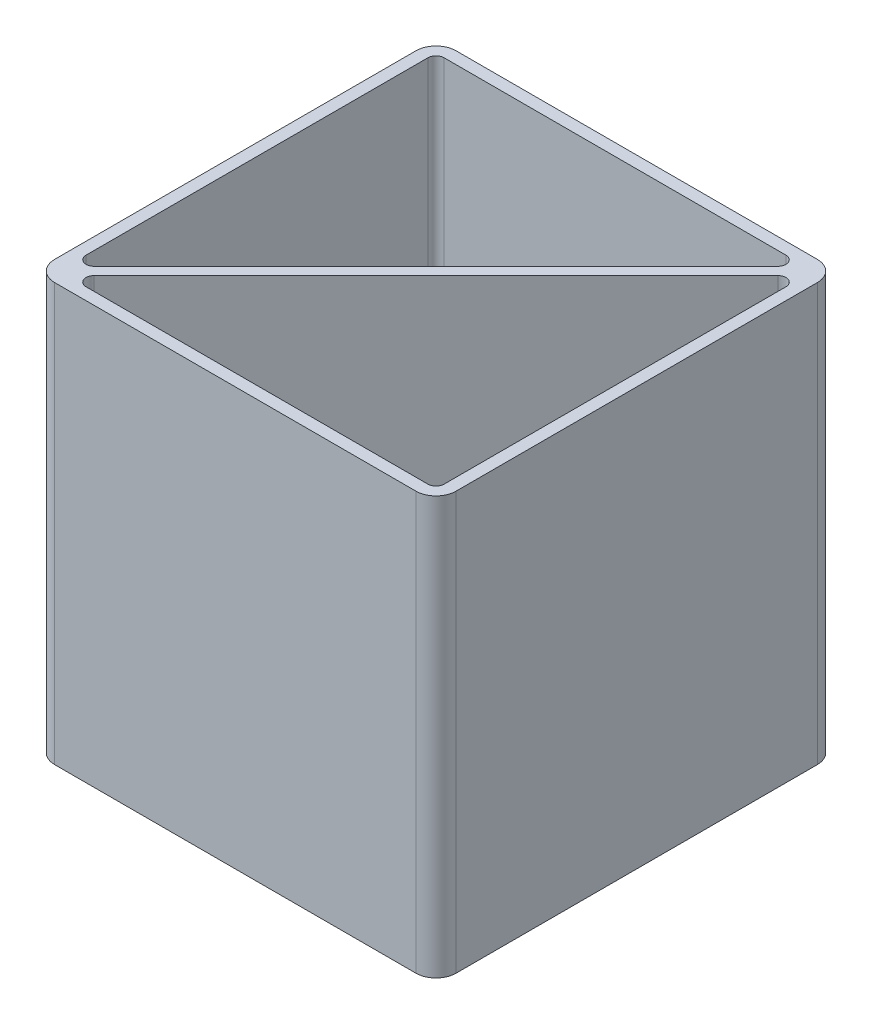
ISO-10303-21;
HEADER;
FILE_DESCRIPTION(('STEP AP214'),'2;1');
FILE_NAME('part.step','',(''),(''),'','','');
FILE_SCHEMA(('AUTOMOTIVE_DESIGN { 1 0 10303 214 1 1 1 1 }'));
ENDSEC;
DATA;
#1=APPLICATION_CONTEXT('core data for automotive mechanical design processes');
#2=APPLICATION_PROTOCOL_DEFINITION('international standard','automotive_design',2000,#1);
#3=PRODUCT_CONTEXT('',#1,'mechanical');
#4=PRODUCT('Part','Part','',(#3));
#5=PRODUCT_RELATED_PRODUCT_CATEGORY('part','',(#4));
#6=PRODUCT_DEFINITION_FORMATION('','',#4);
#7=PRODUCT_DEFINITION_CONTEXT('part definition',#1,'design');
#8=PRODUCT_DEFINITION('design','',#6,#7);
#9=PRODUCT_DEFINITION_SHAPE('','',#8);
#10=(LENGTH_UNIT() NAMED_UNIT(*) SI_UNIT(.MILLI.,.METRE.));
#11=(NAMED_UNIT(*) PLANE_ANGLE_UNIT() SI_UNIT($,.RADIAN.));
#12=(NAMED_UNIT(*) SI_UNIT($,.STERADIAN.) SOLID_ANGLE_UNIT());
#13=UNCERTAINTY_MEASURE_WITH_UNIT(LENGTH_MEASURE(1.E-05),#10,'distance_accuracy_value','');
#14=(GEOMETRIC_REPRESENTATION_CONTEXT(3) GLOBAL_UNCERTAINTY_ASSIGNED_CONTEXT((#13)) GLOBAL_UNIT_ASSIGNED_CONTEXT((#10,
#11,#12)) REPRESENTATION_CONTEXT('',''));
#15=CARTESIAN_POINT('',(0.,0.,0.));
#16=DIRECTION('',(0.,0.,1.));
#17=DIRECTION('',(1.,0.,0.));
#18=AXIS2_PLACEMENT_3D('',#15,#16,#17);
#19=CARTESIAN_POINT('',(-45.,4.,-45.));
#20=DIRECTION('',(0.,-1.,0.));
#21=DIRECTION('',(0.,0.,-1.));
#22=AXIS2_PLACEMENT_3D('',#19,#20,#21);
#23=CYLINDRICAL_SURFACE('',#22,5.);
#24=CARTESIAN_POINT('',(-45.,0.,-45.));
#25=DIRECTION('',(0.,1.,0.));
#26=DIRECTION('',(0.,0.,1.));
#27=AXIS2_PLACEMENT_3D('',#24,#25,#26);
#28=CIRCLE('',#27,5.);
#29=CARTESIAN_POINT('',(-45.,0.,-50.));
#30=VERTEX_POINT('',#29);
#31=CARTESIAN_POINT('',(-50.,0.,-45.));
#32=VERTEX_POINT('',#31);
#33=EDGE_CURVE('E393',#30,#32,#28,.T.);
#34=ORIENTED_EDGE('',*,*,#33,.T.);
#35=DIRECTION('',(0.,-1.,0.));
#36=VECTOR('',#35,1.);
#37=CARTESIAN_POINT('',(-50.,4.,-45.));
#38=LINE('',#37,#36);
#39=CARTESIAN_POINT('',(-50.0000000000001,104.,-44.9999999999998));
#40=VERTEX_POINT('',#39);
#41=EDGE_CURVE('E51',#40,#32,#38,.T.);
#42=ORIENTED_EDGE('',*,*,#41,.F.);
#43=CARTESIAN_POINT('',(-45.0000000000001,104.,-44.9999999999998));
#44=DIRECTION('',(0.,1.,0.));
#45=DIRECTION('',(0.,0.,1.));
#46=AXIS2_PLACEMENT_3D('',#43,#44,#45);
#47=CIRCLE('',#46,5.);
#48=CARTESIAN_POINT('',(-45.0000000000001,104.,-49.9999999999998));
#49=VERTEX_POINT('',#48);
#50=EDGE_CURVE('E348',#49,#40,#47,.T.);
#51=ORIENTED_EDGE('',*,*,#50,.F.);
#52=DIRECTION('',(0.,-1.,0.));
#53=VECTOR('',#52,1.);
#54=CARTESIAN_POINT('',(-45.,4.,-50.));
#55=LINE('',#54,#53);
#56=EDGE_CURVE('E11',#49,#30,#55,.T.);
#57=ORIENTED_EDGE('',*,*,#56,.T.);
#58=EDGE_LOOP('',(#34,#42,#51,#57));
#59=FACE_BOUND('',#58,.T.);
#60=ADVANCED_FACE('F43',(#59),#23,.T.);
#61=CARTESIAN_POINT('',(-50.,4.,0.));
#62=DIRECTION('',(1.,0.,0.));
#63=DIRECTION('',(0.,0.,-1.));
#64=AXIS2_PLACEMENT_3D('',#61,#62,#63);
#65=PLANE('',#64);
#66=DIRECTION('',(0.,0.,1.));
#67=VECTOR('',#66,1.);
#68=CARTESIAN_POINT('',(-50.,0.,0.));
#69=LINE('',#68,#67);
#70=CARTESIAN_POINT('',(-50.,0.,45.));
#71=VERTEX_POINT('',#70);
#72=EDGE_CURVE('E397',#32,#71,#69,.T.);
#73=ORIENTED_EDGE('',*,*,#72,.T.);
#74=DIRECTION('',(0.,-1.,0.));
#75=VECTOR('',#74,1.);
#76=CARTESIAN_POINT('',(-50.,4.,45.));
#77=LINE('',#76,#75);
#78=CARTESIAN_POINT('',(-49.9999999999997,104.,45.0000000000003));
#79=VERTEX_POINT('',#78);
#80=EDGE_CURVE('E457',#79,#71,#77,.T.);
#81=ORIENTED_EDGE('',*,*,#80,.F.);
#82=DIRECTION('',(0.,0.,1.));
#83=VECTOR('',#82,1.);
#84=CARTESIAN_POINT('',(-50.0000000000001,104.,-44.9999999999998));
#85=LINE('',#84,#83);
#86=EDGE_CURVE('E352',#40,#79,#85,.T.);
#87=ORIENTED_EDGE('',*,*,#86,.F.);
#88=ORIENTED_EDGE('',*,*,#41,.T.);
#89=EDGE_LOOP('',(#73,#81,#87,#88));
#90=FACE_BOUND('',#89,.T.);
#91=ADVANCED_FACE('F465',(#90),#65,.F.);
#92=CARTESIAN_POINT('',(-45.,4.,45.));
#93=DIRECTION('',(0.,-1.,0.));
#94=DIRECTION('',(0.,0.,-1.));
#95=AXIS2_PLACEMENT_3D('',#92,#93,#94);
#96=CYLINDRICAL_SURFACE('',#95,5.);
#97=CARTESIAN_POINT('',(-45.,0.,45.));
#98=DIRECTION('',(0.,1.,0.));
#99=DIRECTION('',(0.,0.,1.));
#100=AXIS2_PLACEMENT_3D('',#97,#98,#99);
#101=CIRCLE('',#100,5.);
#102=CARTESIAN_POINT('',(-44.9999999999999,0.,50.));
#103=VERTEX_POINT('',#102);
#104=EDGE_CURVE('E400',#71,#103,#101,.T.);
#105=ORIENTED_EDGE('',*,*,#104,.T.);
#106=DIRECTION('',(0.,-1.,0.));
#107=VECTOR('',#106,1.);
#108=CARTESIAN_POINT('',(-44.9999999999999,4.,50.));
#109=LINE('',#108,#107);
#110=CARTESIAN_POINT('',(-44.9999999999996,104.,50.0000000000003));
#111=VERTEX_POINT('',#110);
#112=EDGE_CURVE('E453',#111,#103,#109,.T.);
#113=ORIENTED_EDGE('',*,*,#112,.F.);
#114=CARTESIAN_POINT('',(-44.9999999999997,104.,45.0000000000003));
#115=DIRECTION('',(0.,1.,0.));
#116=DIRECTION('',(0.,0.,-1.));
#117=AXIS2_PLACEMENT_3D('',#114,#115,#116);
#118=CIRCLE('',#117,5.);
#119=EDGE_CURVE('E356',#79,#111,#118,.T.);
#120=ORIENTED_EDGE('',*,*,#119,.F.);
#121=ORIENTED_EDGE('',*,*,#80,.T.);
#122=EDGE_LOOP('',(#105,#113,#120,#121));
#123=FACE_BOUND('',#122,.T.);
#124=ADVANCED_FACE('F474',(#123),#96,.T.);
#125=CARTESIAN_POINT('',(0.,4.,50.));
#126=DIRECTION('',(0.,0.,-1.));
#127=DIRECTION('',(-1.,0.,0.));
#128=AXIS2_PLACEMENT_3D('',#125,#126,#127);
#129=PLANE('',#128);
#130=DIRECTION('',(1.,0.,0.));
#131=VECTOR('',#130,1.);
#132=CARTESIAN_POINT('',(0.,0.,50.));
#133=LINE('',#132,#131);
#134=CARTESIAN_POINT('',(45.,0.,50.));
#135=VERTEX_POINT('',#134);
#136=EDGE_CURVE('E403',#103,#135,#133,.T.);
#137=ORIENTED_EDGE('',*,*,#136,.T.);
#138=DIRECTION('',(0.,-1.,0.));
#139=VECTOR('',#138,1.);
#140=CARTESIAN_POINT('',(45.,4.,50.));
#141=LINE('',#140,#139);
#142=CARTESIAN_POINT('',(45.0000000000005,104.,49.9999999999995));
#143=VERTEX_POINT('',#142);
#144=EDGE_CURVE('E450',#143,#135,#141,.T.);
#145=ORIENTED_EDGE('',*,*,#144,.F.);
#146=DIRECTION('',(1.,0.,0.));
#147=VECTOR('',#146,1.);
#148=CARTESIAN_POINT('',(-44.9999999999996,104.,50.0000000000003));
#149=LINE('',#148,#147);
#150=EDGE_CURVE('E360',#111,#143,#149,.T.);
#151=ORIENTED_EDGE('',*,*,#150,.F.);
#152=ORIENTED_EDGE('',*,*,#112,.T.);
#153=EDGE_LOOP('',(#137,#145,#151,#152));
#154=FACE_BOUND('',#153,.T.);
#155=ADVANCED_FACE('F478',(#154),#129,.F.);
#156=CARTESIAN_POINT('',(45.,4.,45.));
#157=DIRECTION('',(0.,-1.,0.));
#158=DIRECTION('',(0.,0.,-1.));
#159=AXIS2_PLACEMENT_3D('',#156,#157,#158);
#160=CYLINDRICAL_SURFACE('',#159,5.);
#161=CARTESIAN_POINT('',(45.,0.,45.));
#162=DIRECTION('',(0.,1.,0.));
#163=DIRECTION('',(0.,0.,1.));
#164=AXIS2_PLACEMENT_3D('',#161,#162,#163);
#165=CIRCLE('',#164,5.);
#166=CARTESIAN_POINT('',(50.,0.,44.9999999999999));
#167=VERTEX_POINT('',#166);
#168=EDGE_CURVE('E407',#167,#135,#165,.F.);
#169=ORIENTED_EDGE('',*,*,#168,.F.);
#170=DIRECTION('',(0.,-1.,0.));
#171=VECTOR('',#170,1.);
#172=CARTESIAN_POINT('',(50.,4.,44.9999999999999));
#173=LINE('',#172,#171);
#174=CARTESIAN_POINT('',(50.0000000000005,104.,44.9999999999995));
#175=VERTEX_POINT('',#174);
#176=EDGE_CURVE('E447',#175,#167,#173,.T.);
#177=ORIENTED_EDGE('',*,*,#176,.F.);
#178=CARTESIAN_POINT('',(45.0000000000005,104.,44.9999999999995));
#179=DIRECTION('',(0.,1.,0.));
#180=DIRECTION('',(0.,0.,-1.));
#181=AXIS2_PLACEMENT_3D('',#178,#179,#180);
#182=CIRCLE('',#181,5.);
#183=EDGE_CURVE('E364',#143,#175,#182,.T.);
#184=ORIENTED_EDGE('',*,*,#183,.F.);
#185=ORIENTED_EDGE('',*,*,#144,.T.);
#186=EDGE_LOOP('',(#169,#177,#184,#185));
#187=FACE_BOUND('',#186,.T.);
#188=ADVANCED_FACE('F485',(#187),#160,.T.);
#189=CARTESIAN_POINT('',(50.,4.,0.));
#190=DIRECTION('',(-1.,0.,0.));
#191=DIRECTION('',(0.,0.,1.));
#192=AXIS2_PLACEMENT_3D('',#189,#190,#191);
#193=PLANE('',#192);
#194=DIRECTION('',(0.,0.,-1.));
#195=VECTOR('',#194,1.);
#196=CARTESIAN_POINT('',(50.,0.,0.));
#197=LINE('',#196,#195);
#198=CARTESIAN_POINT('',(50.,0.,-45.));
#199=VERTEX_POINT('',#198);
#200=EDGE_CURVE('E411',#167,#199,#197,.T.);
#201=ORIENTED_EDGE('',*,*,#200,.T.);
#202=DIRECTION('',(0.,-1.,0.));
#203=VECTOR('',#202,1.);
#204=CARTESIAN_POINT('',(50.,4.,-45.));
#205=LINE('',#204,#203);
#206=CARTESIAN_POINT('',(50.,104.,-45.));
#207=VERTEX_POINT('',#206);
#208=EDGE_CURVE('E444',#207,#199,#205,.T.);
#209=ORIENTED_EDGE('',*,*,#208,.F.);
#210=DIRECTION('',(0.,0.,-1.));
#211=VECTOR('',#210,1.);
#212=CARTESIAN_POINT('',(50.0000000000005,104.,44.9999999999995));
#213=LINE('',#212,#211);
#214=EDGE_CURVE('E368',#175,#207,#213,.T.);
#215=ORIENTED_EDGE('',*,*,#214,.F.);
#216=ORIENTED_EDGE('',*,*,#176,.T.);
#217=EDGE_LOOP('',(#201,#209,#215,#216));
#218=FACE_BOUND('',#217,.T.);
#219=ADVANCED_FACE('F488',(#218),#193,.F.);
#220=CARTESIAN_POINT('',(45.,4.,-45.));
#221=DIRECTION('',(0.,-1.,0.));
#222=DIRECTION('',(0.,0.,-1.));
#223=AXIS2_PLACEMENT_3D('',#220,#221,#222);
#224=CYLINDRICAL_SURFACE('',#223,5.);
#225=CARTESIAN_POINT('',(45.,0.,-45.));
#226=DIRECTION('',(0.,1.,0.));
#227=DIRECTION('',(0.,0.,1.));
#228=AXIS2_PLACEMENT_3D('',#225,#226,#227);
#229=CIRCLE('',#228,5.);
#230=CARTESIAN_POINT('',(45.,0.,-50.));
#231=VERTEX_POINT('',#230);
#232=EDGE_CURVE('E415',#231,#199,#229,.F.);
#233=ORIENTED_EDGE('',*,*,#232,.F.);
#234=DIRECTION('',(0.,-1.,0.));
#235=VECTOR('',#234,1.);
#236=CARTESIAN_POINT('',(45.,4.,-50.));
#237=LINE('',#236,#235);
#238=CARTESIAN_POINT('',(45.,104.,-50.));
#239=VERTEX_POINT('',#238);
#240=EDGE_CURVE('E441',#239,#231,#237,.T.);
#241=ORIENTED_EDGE('',*,*,#240,.F.);
#242=CARTESIAN_POINT('',(45.,104.,-45.));
#243=DIRECTION('',(0.,1.,0.));
#244=DIRECTION('',(0.,0.,1.));
#245=AXIS2_PLACEMENT_3D('',#242,#243,#244);
#246=CIRCLE('',#245,5.);
#247=EDGE_CURVE('E340',#207,#239,#246,.T.);
#248=ORIENTED_EDGE('',*,*,#247,.F.);
#249=ORIENTED_EDGE('',*,*,#208,.T.);
#250=EDGE_LOOP('',(#233,#241,#248,#249));
#251=FACE_BOUND('',#250,.T.);
#252=ADVANCED_FACE('F493',(#251),#224,.T.);
#253=CARTESIAN_POINT('',(0.,4.,-50.));
#254=DIRECTION('',(0.,0.,1.));
#255=DIRECTION('',(1.,0.,0.));
#256=AXIS2_PLACEMENT_3D('',#253,#254,#255);
#257=PLANE('',#256);
#258=DIRECTION('',(-1.,0.,0.));
#259=VECTOR('',#258,1.);
#260=CARTESIAN_POINT('',(0.,0.,-50.));
#261=LINE('',#260,#259);
#262=CARTESIAN_POINT('',(-29.1545641092678,0.,-50.));
#263=VERTEX_POINT('',#262);
#264=EDGE_CURVE('E394',#231,#263,#261,.T.);
#265=ORIENTED_EDGE('',*,*,#264,.T.);
#266=DIRECTION('',(0.,-1.,0.));
#267=VECTOR('',#266,1.);
#268=CARTESIAN_POINT('',(-29.1545641092678,4.,-50.));
#269=LINE('',#268,#267);
#270=CARTESIAN_POINT('',(-29.1545641092677,4.,-49.9999999999999));
#271=VERTEX_POINT('',#270);
#272=EDGE_CURVE('E438',#271,#263,#269,.T.);
#273=ORIENTED_EDGE('',*,*,#272,.F.);
#274=DIRECTION('',(-1.,0.,0.));
#275=VECTOR('',#274,1.);
#276=CARTESIAN_POINT('',(45.,4.,-50.));
#277=LINE('',#276,#275);
#278=CARTESIAN_POINT('',(-29.6579632829267,4.,-49.9999999999999));
#279=VERTEX_POINT('',#278);
#280=EDGE_CURVE('E339',#271,#279,#277,.T.);
#281=ORIENTED_EDGE('',*,*,#280,.T.);
#282=DIRECTION('',(0.,-1.,0.));
#283=VECTOR('',#282,1.);
#284=CARTESIAN_POINT('',(-29.6579632829269,4.,-50.));
#285=LINE('',#284,#283);
#286=CARTESIAN_POINT('',(-29.6579632829269,0.,-50.));
#287=VERTEX_POINT('',#286);
#288=EDGE_CURVE('E389',#279,#287,#285,.T.);
#289=ORIENTED_EDGE('',*,*,#288,.T.);
#290=EDGE_CURVE('E372',#287,#30,#261,.T.);
#291=ORIENTED_EDGE('',*,*,#290,.T.);
#292=ORIENTED_EDGE('',*,*,#56,.F.);
#293=DIRECTION('',(-1.,0.,0.));
#294=VECTOR('',#293,1.);
#295=CARTESIAN_POINT('',(45.,104.,-50.));
#296=LINE('',#295,#294);
#297=EDGE_CURVE('E344',#239,#49,#296,.T.);
#298=ORIENTED_EDGE('',*,*,#297,.F.);
#299=ORIENTED_EDGE('',*,*,#240,.T.);
#300=EDGE_LOOP('',(#265,#273,#281,#289,#291,#292,#298,#299));
#301=FACE_BOUND('',#300,.T.);
#302=ADVANCED_FACE('F497',(#301),#257,.F.);
#303=CARTESIAN_POINT('',(10.1117929880745,4.,-9.90209532299714));
#304=DIRECTION('',(-0.714476351835462,0.,0.699659590563789));
#305=DIRECTION('',(0.699659590563789,0.,0.714476351835462));
#306=AXIS2_PLACEMENT_3D('',#303,#304,#305);
#307=PLANE('',#306);
#308=DIRECTION('',(-0.699659590563789,0.,-0.714476351835462));
#309=VECTOR('',#308,1.);
#310=CARTESIAN_POINT('',(10.1117929880745,0.,-9.90209532299714));
#311=LINE('',#310,#309);
#312=CARTESIAN_POINT('',(-29.1519548178983,0.,-49.9973354514056));
#313=VERTEX_POINT('',#312);
#314=EDGE_CURVE('E419',#313,#263,#311,.T.);
#315=ORIENTED_EDGE('',*,*,#314,.F.);
#316=DIRECTION('',(0.,-1.,0.));
#317=VECTOR('',#316,1.);
#318=CARTESIAN_POINT('',(-29.1519548178983,4.,-49.9973354514056));
#319=LINE('',#318,#317);
#320=CARTESIAN_POINT('',(-29.1519548178983,4.,-49.9973354514056));
#321=VERTEX_POINT('',#320);
#322=EDGE_CURVE('E435',#321,#313,#319,.T.);
#323=ORIENTED_EDGE('',*,*,#322,.F.);
#324=DIRECTION('',(-0.699659590563789,0.,-0.714476351835462));
#325=VECTOR('',#324,1.);
#326=CARTESIAN_POINT('',(10.1117929880745,4.,-9.90209532299714));
#327=LINE('',#326,#325);
#328=EDGE_CURVE('E376',#321,#271,#327,.T.);
#329=ORIENTED_EDGE('',*,*,#328,.T.);
#330=ORIENTED_EDGE('',*,*,#272,.T.);
#331=EDGE_LOOP('',(#315,#323,#329,#330));
#332=FACE_BOUND('',#331,.T.);
#333=ADVANCED_FACE('F509',(#332),#307,.T.);
#334=CARTESIAN_POINT('',(-39.2637478059728,4.,-40.0952401284085));
#335=DIRECTION('',(-0.699659590563789,0.,-0.714476351835462));
#336=DIRECTION('',(-0.714476351835462,0.,0.699659590563789));
#337=AXIS2_PLACEMENT_3D('',#334,#335,#336);
#338=PLANE('',#337);
#339=DIRECTION('',(0.714476351835462,0.,-0.699659590563789));
#340=VECTOR('',#339,1.);
#341=CARTESIAN_POINT('',(-39.2637478059728,0.,-40.0952401284085));
#342=LINE('',#341,#340);
#343=CARTESIAN_POINT('',(-29.4089282446917,0.,-49.745691121801));
#344=VERTEX_POINT('',#343);
#345=EDGE_CURVE('E423',#344,#313,#342,.T.);
#346=ORIENTED_EDGE('',*,*,#345,.F.);
#347=DIRECTION('',(0.,-1.,0.));
#348=VECTOR('',#347,1.);
#349=CARTESIAN_POINT('',(-29.4089282446917,4.,-49.745691121801));
#350=LINE('',#349,#348);
#351=CARTESIAN_POINT('',(-29.4089282446917,4.,-49.745691121801));
#352=VERTEX_POINT('',#351);
#353=EDGE_CURVE('E432',#352,#344,#350,.T.);
#354=ORIENTED_EDGE('',*,*,#353,.F.);
#355=DIRECTION('',(0.714476351835462,0.,-0.699659590563789));
#356=VECTOR('',#355,1.);
#357=CARTESIAN_POINT('',(-39.2637478059728,4.,-40.0952401284085));
#358=LINE('',#357,#356);
#359=EDGE_CURVE('E380',#352,#321,#358,.T.);
#360=ORIENTED_EDGE('',*,*,#359,.T.);
#361=ORIENTED_EDGE('',*,*,#322,.T.);
#362=EDGE_LOOP('',(#346,#354,#360,#361));
#363=FACE_BOUND('',#362,.T.);
#364=ADVANCED_FACE('F505',(#363),#338,.T.);
#365=CARTESIAN_POINT('',(9.85481956128111,4.,-9.65045099339246));
#366=DIRECTION('',(0.714476351835462,0.,-0.699659590563789));
#367=DIRECTION('',(-0.699659590563789,0.,-0.714476351835462));
#368=AXIS2_PLACEMENT_3D('',#365,#366,#367);
#369=PLANE('',#368);
#370=DIRECTION('',(0.699659590563789,0.,0.714476351835462));
#371=VECTOR('',#370,1.);
#372=CARTESIAN_POINT('',(9.85481956128111,0.,-9.65045099339246));
#373=LINE('',#372,#371);
#374=EDGE_CURVE('E381',#287,#344,#373,.T.);
#375=ORIENTED_EDGE('',*,*,#374,.F.);
#376=ORIENTED_EDGE('',*,*,#288,.F.);
#377=DIRECTION('',(0.699659590563789,0.,0.714476351835462));
#378=VECTOR('',#377,1.);
#379=CARTESIAN_POINT('',(9.85481956128111,4.,-9.65045099339246));
#380=LINE('',#379,#378);
#381=EDGE_CURVE('E385',#279,#352,#380,.T.);
#382=ORIENTED_EDGE('',*,*,#381,.T.);
#383=ORIENTED_EDGE('',*,*,#353,.T.);
#384=EDGE_LOOP('',(#375,#376,#382,#383));
#385=FACE_BOUND('',#384,.T.);
#386=ADVANCED_FACE('F501',(#385),#369,.T.);
#387=CARTESIAN_POINT('',(0.,0.,0.));
#388=DIRECTION('',(0.,1.,0.));
#389=DIRECTION('',(0.,0.,1.));
#390=AXIS2_PLACEMENT_3D('',#387,#388,#389);
#391=PLANE('',#390);
#392=ORIENTED_EDGE('',*,*,#290,.F.);
#393=ORIENTED_EDGE('',*,*,#374,.T.);
#394=ORIENTED_EDGE('',*,*,#345,.T.);
#395=ORIENTED_EDGE('',*,*,#314,.T.);
#396=ORIENTED_EDGE('',*,*,#264,.F.);
#397=ORIENTED_EDGE('',*,*,#232,.T.);
#398=ORIENTED_EDGE('',*,*,#200,.F.);
#399=ORIENTED_EDGE('',*,*,#168,.T.);
#400=ORIENTED_EDGE('',*,*,#136,.F.);
#401=ORIENTED_EDGE('',*,*,#104,.F.);
#402=ORIENTED_EDGE('',*,*,#72,.F.);
#403=ORIENTED_EDGE('',*,*,#33,.F.);
#404=EDGE_LOOP('',(#392,#393,#394,#395,#396,#397,#398,#399,#400,#401,#402,#403));
#405=FACE_BOUND('',#404,.T.);
#406=ADVANCED_FACE('F471',(#405),#391,.F.);
#407=CARTESIAN_POINT('',(45.,104.,-45.));
#408=DIRECTION('',(0.,1.,0.));
#409=DIRECTION('',(0.,0.,1.));
#410=AXIS2_PLACEMENT_3D('',#407,#408,#409);
#411=PLANE('',#410);
#412=ORIENTED_EDGE('',*,*,#247,.T.);
#413=ORIENTED_EDGE('',*,*,#297,.T.);
#414=ORIENTED_EDGE('',*,*,#50,.T.);
#415=ORIENTED_EDGE('',*,*,#86,.T.);
#416=ORIENTED_EDGE('',*,*,#119,.T.);
#417=ORIENTED_EDGE('',*,*,#150,.T.);
#418=ORIENTED_EDGE('',*,*,#183,.T.);
#419=ORIENTED_EDGE('',*,*,#214,.T.);
#420=EDGE_LOOP('',(#412,#413,#414,#415,#416,#417,#418,#419));
#421=FACE_BOUND('',#420,.T.);
#422=DIRECTION('',(-0.707106781186547,0.,0.707106781186548));
#423=VECTOR('',#422,1.);
#424=CARTESIAN_POINT('',(43.5857864376274,104.,-41.5857864376269));
#425=LINE('',#424,#423);
#426=CARTESIAN_POINT('',(43.5857864376274,104.,-41.5857864376269));
#427=VERTEX_POINT('',#426);
#428=CARTESIAN_POINT('',(-41.5857864376265,104.,43.5857864376272));
#429=VERTEX_POINT('',#428);
#430=EDGE_CURVE('E282',#427,#429,#425,.T.);
#431=ORIENTED_EDGE('',*,*,#430,.F.);
#432=CARTESIAN_POINT('',(45.0000000000005,104.,-40.1715728752538));
#433=DIRECTION('',(0.,1.,0.));
#434=DIRECTION('',(0.,0.,-1.));
#435=AXIS2_PLACEMENT_3D('',#432,#433,#434);
#436=CIRCLE('',#435,2.);
#437=CARTESIAN_POINT('',(47.0000000000005,104.,-40.1715728752537));
#438=VERTEX_POINT('',#437);
#439=EDGE_CURVE('E279',#438,#427,#436,.T.);
#440=ORIENTED_EDGE('',*,*,#439,.F.);
#441=DIRECTION('',(0.,0.,-1.));
#442=VECTOR('',#441,1.);
#443=CARTESIAN_POINT('',(47.0000000000005,104.,44.9999999999995));
#444=LINE('',#443,#442);
#445=CARTESIAN_POINT('',(47.0000000000005,104.,44.9999999999995));
#446=VERTEX_POINT('',#445);
#447=EDGE_CURVE('E296',#446,#438,#444,.T.);
#448=ORIENTED_EDGE('',*,*,#447,.F.);
#449=CARTESIAN_POINT('',(45.0000000000005,104.,44.9999999999995));
#450=DIRECTION('',(0.,1.,0.));
#451=DIRECTION('',(0.,0.,-1.));
#452=AXIS2_PLACEMENT_3D('',#449,#450,#451);
#453=CIRCLE('',#452,2.00000000000039);
#454=CARTESIAN_POINT('',(45.0000000000005,104.,47.0000000000003));
#455=VERTEX_POINT('',#454);
#456=EDGE_CURVE('E292',#455,#446,#453,.T.);
#457=ORIENTED_EDGE('',*,*,#456,.F.);
#458=DIRECTION('',(1.,0.,0.));
#459=VECTOR('',#458,1.);
#460=CARTESIAN_POINT('',(-40.1715728752534,104.,47.0000000000003));
#461=LINE('',#460,#459);
#462=CARTESIAN_POINT('',(-40.1715728752534,104.,47.0000000000003));
#463=VERTEX_POINT('',#462);
#464=EDGE_CURVE('E289',#463,#455,#461,.T.);
#465=ORIENTED_EDGE('',*,*,#464,.F.);
#466=CARTESIAN_POINT('',(-40.1715728752534,104.,45.0000000000003));
#467=DIRECTION('',(0.,1.,0.));
#468=DIRECTION('',(0.,0.,-1.));
#469=AXIS2_PLACEMENT_3D('',#466,#467,#468);
#470=CIRCLE('',#469,2.);
#471=EDGE_CURVE('E286',#429,#463,#470,.T.);
#472=ORIENTED_EDGE('',*,*,#471,.F.);
#473=EDGE_LOOP('',(#431,#440,#448,#457,#465,#472));
#474=FACE_BOUND('',#473,.T.);
#475=DIRECTION('',(0.,0.,1.));
#476=VECTOR('',#475,1.);
#477=CARTESIAN_POINT('',(-47.0000000000001,104.,-44.9999999999998));
#478=LINE('',#477,#476);
#479=CARTESIAN_POINT('',(-47.0000000000001,104.,-44.9999999999998));
#480=VERTEX_POINT('',#479);
#481=CARTESIAN_POINT('',(-47.0000000000001,104.,40.171572875254));
#482=VERTEX_POINT('',#481);
#483=EDGE_CURVE('E215',#480,#482,#478,.T.);
#484=ORIENTED_EDGE('',*,*,#483,.F.);
#485=CARTESIAN_POINT('',(-45.0000000000001,104.,-44.9999999999998));
#486=DIRECTION('',(0.,1.,0.));
#487=DIRECTION('',(0.,0.,1.));
#488=AXIS2_PLACEMENT_3D('',#485,#486,#487);
#489=CIRCLE('',#488,2.00000000000008);
#490=CARTESIAN_POINT('',(-45.0000000000001,104.,-47.));
#491=VERTEX_POINT('',#490);
#492=EDGE_CURVE('E206',#491,#480,#489,.T.);
#493=ORIENTED_EDGE('',*,*,#492,.F.);
#494=DIRECTION('',(-1.,0.,0.));
#495=VECTOR('',#494,1.);
#496=CARTESIAN_POINT('',(40.1715728752538,104.,-47.));
#497=LINE('',#496,#495);
#498=CARTESIAN_POINT('',(40.1715728752538,104.,-47.));
#499=VERTEX_POINT('',#498);
#500=EDGE_CURVE('E243',#499,#491,#497,.T.);
#501=ORIENTED_EDGE('',*,*,#500,.F.);
#502=CARTESIAN_POINT('',(40.1715728752538,104.,-45.));
#503=DIRECTION('',(0.,1.,0.));
#504=DIRECTION('',(0.,0.,1.));
#505=AXIS2_PLACEMENT_3D('',#502,#503,#504);
#506=CIRCLE('',#505,2.);
#507=CARTESIAN_POINT('',(41.5857864376269,104.,-43.5857864376269));
#508=VERTEX_POINT('',#507);
#509=EDGE_CURVE('E239',#508,#499,#506,.T.);
#510=ORIENTED_EDGE('',*,*,#509,.F.);
#511=DIRECTION('',(0.707106781186547,0.,-0.707106781186548));
#512=VECTOR('',#511,1.);
#513=CARTESIAN_POINT('',(-43.585786437627,104.,41.5857864376272));
#514=LINE('',#513,#512);
#515=CARTESIAN_POINT('',(-43.585786437627,104.,41.5857864376272));
#516=VERTEX_POINT('',#515);
#517=EDGE_CURVE('E234',#516,#508,#514,.T.);
#518=ORIENTED_EDGE('',*,*,#517,.F.);
#519=CARTESIAN_POINT('',(-45.0000000000001,104.,40.1715728752541));
#520=DIRECTION('',(0.,1.,0.));
#521=DIRECTION('',(0.,0.,-1.));
#522=AXIS2_PLACEMENT_3D('',#519,#520,#521);
#523=CIRCLE('',#522,2.);
#524=EDGE_CURVE('E230',#482,#516,#523,.T.);
#525=ORIENTED_EDGE('',*,*,#524,.F.);
#526=EDGE_LOOP('',(#484,#493,#501,#510,#518,#525));
#527=FACE_BOUND('',#526,.T.);
#528=ADVANCED_FACE('F228',(#421,#474,#527),#411,.T.);
#529=CARTESIAN_POINT('',(45.,4.,-45.));
#530=DIRECTION('',(0.,1.,0.));
#531=DIRECTION('',(0.,0.,1.));
#532=AXIS2_PLACEMENT_3D('',#529,#530,#531);
#533=PLANE('',#532);
#534=ORIENTED_EDGE('',*,*,#328,.F.);
#535=ORIENTED_EDGE('',*,*,#359,.F.);
#536=ORIENTED_EDGE('',*,*,#381,.F.);
#537=ORIENTED_EDGE('',*,*,#280,.F.);
#538=EDGE_LOOP('',(#534,#535,#536,#537));
#539=FACE_BOUND('',#538,.T.);
#540=ADVANCED_FACE('F513',(#539),#533,.F.);
#541=CARTESIAN_POINT('',(45.0000000000005,104.,-40.1715728752538));
#542=DIRECTION('',(0.,-1.,0.));
#543=DIRECTION('',(0.,0.,-1.));
#544=AXIS2_PLACEMENT_3D('',#541,#542,#543);
#545=CYLINDRICAL_SURFACE('',#544,2.);
#546=CARTESIAN_POINT('',(45.0000000000005,4.,-40.1715728752538));
#547=DIRECTION('',(0.,1.,0.));
#548=DIRECTION('',(0.,0.,-1.));
#549=AXIS2_PLACEMENT_3D('',#546,#547,#548);
#550=CIRCLE('',#549,2.);
#551=CARTESIAN_POINT('',(47.0000000000005,4.,-40.1715728752537));
#552=VERTEX_POINT('',#551);
#553=CARTESIAN_POINT('',(43.5857864376274,4.,-41.5857864376269));
#554=VERTEX_POINT('',#553);
#555=EDGE_CURVE('E224',#552,#554,#550,.T.);
#556=ORIENTED_EDGE('',*,*,#555,.F.);
#557=DIRECTION('',(0.,-1.,0.));
#558=VECTOR('',#557,1.);
#559=CARTESIAN_POINT('',(47.0000000000005,104.,-40.1715728752537));
#560=LINE('',#559,#558);
#561=EDGE_CURVE('E58',#438,#552,#560,.T.);
#562=ORIENTED_EDGE('',*,*,#561,.F.);
#563=ORIENTED_EDGE('',*,*,#439,.T.);
#564=DIRECTION('',(0.,-1.,0.));
#565=VECTOR('',#564,1.);
#566=CARTESIAN_POINT('',(43.5857864376274,104.,-41.5857864376269));
#567=LINE('',#566,#565);
#568=EDGE_CURVE('E335',#427,#554,#567,.T.);
#569=ORIENTED_EDGE('',*,*,#568,.T.);
#570=EDGE_LOOP('',(#556,#562,#563,#569));
#571=FACE_BOUND('',#570,.T.);
#572=ADVANCED_FACE('F515',(#571),#545,.F.);
#573=CARTESIAN_POINT('',(43.5857864376274,104.,-41.5857864376269));
#574=DIRECTION('',(0.707106781186548,0.,0.707106781186547));
#575=DIRECTION('',(0.707106781186547,0.,-0.707106781186548));
#576=AXIS2_PLACEMENT_3D('',#573,#574,#575);
#577=PLANE('',#576);
#578=DIRECTION('',(-0.707106781186547,0.,0.707106781186548));
#579=VECTOR('',#578,1.);
#580=CARTESIAN_POINT('',(43.5857864376274,4.,-41.5857864376269));
#581=LINE('',#580,#579);
#582=CARTESIAN_POINT('',(-41.5857864376265,4.,43.5857864376272));
#583=VERTEX_POINT('',#582);
#584=EDGE_CURVE('E302',#554,#583,#581,.T.);
#585=ORIENTED_EDGE('',*,*,#584,.F.);
#586=ORIENTED_EDGE('',*,*,#568,.F.);
#587=ORIENTED_EDGE('',*,*,#430,.T.);
#588=DIRECTION('',(0.,-1.,0.));
#589=VECTOR('',#588,1.);
#590=CARTESIAN_POINT('',(-41.5857864376265,104.,43.5857864376272));
#591=LINE('',#590,#589);
#592=EDGE_CURVE('E332',#429,#583,#591,.T.);
#593=ORIENTED_EDGE('',*,*,#592,.T.);
#594=EDGE_LOOP('',(#585,#586,#587,#593));
#595=FACE_BOUND('',#594,.T.);
#596=ADVANCED_FACE('F521',(#595),#577,.T.);
#597=CARTESIAN_POINT('',(-40.1715728752534,104.,45.0000000000003));
#598=DIRECTION('',(0.,-1.,0.));
#599=DIRECTION('',(0.,0.,-1.));
#600=AXIS2_PLACEMENT_3D('',#597,#598,#599);
#601=CYLINDRICAL_SURFACE('',#600,2.);
#602=CARTESIAN_POINT('',(-40.1715728752534,4.,45.0000000000003));
#603=DIRECTION('',(0.,1.,0.));
#604=DIRECTION('',(0.,0.,-1.));
#605=AXIS2_PLACEMENT_3D('',#602,#603,#604);
#606=CIRCLE('',#605,2.);
#607=CARTESIAN_POINT('',(-40.1715728752534,4.,47.0000000000003));
#608=VERTEX_POINT('',#607);
#609=EDGE_CURVE('E306',#583,#608,#606,.T.);
#610=ORIENTED_EDGE('',*,*,#609,.F.);
#611=ORIENTED_EDGE('',*,*,#592,.F.);
#612=ORIENTED_EDGE('',*,*,#471,.T.);
#613=DIRECTION('',(0.,-1.,0.));
#614=VECTOR('',#613,1.);
#615=CARTESIAN_POINT('',(-40.1715728752534,104.,47.0000000000003));
#616=LINE('',#615,#614);
#617=EDGE_CURVE('E329',#463,#608,#616,.T.);
#618=ORIENTED_EDGE('',*,*,#617,.T.);
#619=EDGE_LOOP('',(#610,#611,#612,#618));
#620=FACE_BOUND('',#619,.T.);
#621=ADVANCED_FACE('F581',(#620),#601,.F.);
#622=CARTESIAN_POINT('',(-40.1715728752534,104.,47.0000000000003));
#623=DIRECTION('',(0.,0.,-1.));
#624=DIRECTION('',(-1.,0.,0.));
#625=AXIS2_PLACEMENT_3D('',#622,#623,#624);
#626=PLANE('',#625);
#627=DIRECTION('',(1.,0.,0.));
#628=VECTOR('',#627,1.);
#629=CARTESIAN_POINT('',(-40.1715728752534,4.,47.0000000000003));
#630=LINE('',#629,#628);
#631=CARTESIAN_POINT('',(45.0000000000005,4.,47.0000000000003));
#632=VERTEX_POINT('',#631);
#633=EDGE_CURVE('E310',#608,#632,#630,.T.);
#634=ORIENTED_EDGE('',*,*,#633,.F.);
#635=ORIENTED_EDGE('',*,*,#617,.F.);
#636=ORIENTED_EDGE('',*,*,#464,.T.);
#637=DIRECTION('',(0.,-1.,0.));
#638=VECTOR('',#637,1.);
#639=CARTESIAN_POINT('',(45.0000000000005,104.,47.0000000000003));
#640=LINE('',#639,#638);
#641=EDGE_CURVE('E326',#455,#632,#640,.T.);
#642=ORIENTED_EDGE('',*,*,#641,.T.);
#643=EDGE_LOOP('',(#634,#635,#636,#642));
#644=FACE_BOUND('',#643,.T.);
#645=ADVANCED_FACE('F584',(#644),#626,.T.);
#646=CARTESIAN_POINT('',(45.0000000000005,104.,44.9999999999995));
#647=DIRECTION('',(0.,-1.,0.));
#648=DIRECTION('',(0.,0.,-1.));
#649=AXIS2_PLACEMENT_3D('',#646,#647,#648);
#650=CYLINDRICAL_SURFACE('',#649,2.00000000000039);
#651=CARTESIAN_POINT('',(45.0000000000005,4.,44.9999999999995));
#652=DIRECTION('',(0.,1.,0.));
#653=DIRECTION('',(0.,0.,-1.));
#654=AXIS2_PLACEMENT_3D('',#651,#652,#653);
#655=CIRCLE('',#654,2.00000000000039);
#656=CARTESIAN_POINT('',(47.0000000000009,4.,44.9999999999995));
#657=VERTEX_POINT('',#656);
#658=EDGE_CURVE('E314',#632,#657,#655,.T.);
#659=ORIENTED_EDGE('',*,*,#658,.F.);
#660=ORIENTED_EDGE('',*,*,#641,.F.);
#661=ORIENTED_EDGE('',*,*,#456,.T.);
#662=DIRECTION('',(0.,-1.,0.));
#663=VECTOR('',#662,1.);
#664=CARTESIAN_POINT('',(47.0000000000009,104.,44.9999999999995));
#665=LINE('',#664,#663);
#666=EDGE_CURVE('E323',#446,#657,#665,.T.);
#667=ORIENTED_EDGE('',*,*,#666,.T.);
#668=EDGE_LOOP('',(#659,#660,#661,#667));
#669=FACE_BOUND('',#668,.T.);
#670=ADVANCED_FACE('F570',(#669),#650,.F.);
#671=CARTESIAN_POINT('',(47.0000000000005,104.,44.9999999999995));
#672=DIRECTION('',(-1.,0.,0.));
#673=DIRECTION('',(0.,0.,1.));
#674=AXIS2_PLACEMENT_3D('',#671,#672,#673);
#675=PLANE('',#674);
#676=DIRECTION('',(0.,0.,-1.));
#677=VECTOR('',#676,1.);
#678=CARTESIAN_POINT('',(47.0000000000005,4.,44.9999999999995));
#679=LINE('',#678,#677);
#680=EDGE_CURVE('E283',#657,#552,#679,.T.);
#681=ORIENTED_EDGE('',*,*,#680,.F.);
#682=ORIENTED_EDGE('',*,*,#666,.F.);
#683=ORIENTED_EDGE('',*,*,#447,.T.);
#684=ORIENTED_EDGE('',*,*,#561,.T.);
#685=EDGE_LOOP('',(#681,#682,#683,#684));
#686=FACE_BOUND('',#685,.T.);
#687=ADVANCED_FACE('F565',(#686),#675,.T.);
#688=CARTESIAN_POINT('',(-45.0000000000001,104.,-44.9999999999998));
#689=DIRECTION('',(0.,-1.,0.));
#690=DIRECTION('',(0.,0.,-1.));
#691=AXIS2_PLACEMENT_3D('',#688,#689,#690);
#692=CYLINDRICAL_SURFACE('',#691,2.00000000000008);
#693=CARTESIAN_POINT('',(-45.0000000000001,4.,-44.9999999999998));
#694=DIRECTION('',(0.,1.,0.));
#695=DIRECTION('',(0.,0.,1.));
#696=AXIS2_PLACEMENT_3D('',#693,#694,#695);
#697=CIRCLE('',#696,2.00000000000008);
#698=CARTESIAN_POINT('',(-45.0000000000001,4.,-47.));
#699=VERTEX_POINT('',#698);
#700=CARTESIAN_POINT('',(-47.0000000000001,4.,-44.9999999999998));
#701=VERTEX_POINT('',#700);
#702=EDGE_CURVE('E246',#699,#701,#697,.T.);
#703=ORIENTED_EDGE('',*,*,#702,.F.);
#704=DIRECTION('',(0.,-1.,0.));
#705=VECTOR('',#704,1.);
#706=CARTESIAN_POINT('',(-45.0000000000001,104.,-47.));
#707=LINE('',#706,#705);
#708=EDGE_CURVE('E66',#491,#699,#707,.T.);
#709=ORIENTED_EDGE('',*,*,#708,.F.);
#710=ORIENTED_EDGE('',*,*,#492,.T.);
#711=DIRECTION('',(0.,-1.,0.));
#712=VECTOR('',#711,1.);
#713=CARTESIAN_POINT('',(-47.0000000000001,104.,-44.9999999999998));
#714=LINE('',#713,#712);
#715=EDGE_CURVE('E209',#480,#701,#714,.T.);
#716=ORIENTED_EDGE('',*,*,#715,.T.);
#717=EDGE_LOOP('',(#703,#709,#710,#716));
#718=FACE_BOUND('',#717,.T.);
#719=ADVANCED_FACE('F208',(#718),#692,.F.);
#720=CARTESIAN_POINT('',(-47.0000000000001,104.,-44.9999999999998));
#721=DIRECTION('',(1.,0.,0.));
#722=DIRECTION('',(0.,0.,-1.));
#723=AXIS2_PLACEMENT_3D('',#720,#721,#722);
#724=PLANE('',#723);
#725=DIRECTION('',(0.,0.,1.));
#726=VECTOR('',#725,1.);
#727=CARTESIAN_POINT('',(-47.0000000000001,4.,-44.9999999999998));
#728=LINE('',#727,#726);
#729=CARTESIAN_POINT('',(-47.0000000000001,4.,40.171572875254));
#730=VERTEX_POINT('',#729);
#731=EDGE_CURVE('E222',#701,#730,#728,.T.);
#732=ORIENTED_EDGE('',*,*,#731,.F.);
#733=ORIENTED_EDGE('',*,*,#715,.F.);
#734=ORIENTED_EDGE('',*,*,#483,.T.);
#735=DIRECTION('',(0.,-1.,0.));
#736=VECTOR('',#735,1.);
#737=CARTESIAN_POINT('',(-47.0000000000001,104.,40.171572875254));
#738=LINE('',#737,#736);
#739=EDGE_CURVE('E225',#482,#730,#738,.T.);
#740=ORIENTED_EDGE('',*,*,#739,.T.);
#741=EDGE_LOOP('',(#732,#733,#734,#740));
#742=FACE_BOUND('',#741,.T.);
#743=ADVANCED_FACE('F219',(#742),#724,.T.);
#744=CARTESIAN_POINT('',(-45.0000000000001,104.,40.1715728752541));
#745=DIRECTION('',(0.,-1.,0.));
#746=DIRECTION('',(0.,0.,-1.));
#747=AXIS2_PLACEMENT_3D('',#744,#745,#746);
#748=CYLINDRICAL_SURFACE('',#747,2.);
#749=CARTESIAN_POINT('',(-45.0000000000001,4.,40.1715728752541));
#750=DIRECTION('',(0.,1.,0.));
#751=DIRECTION('',(0.,0.,-1.));
#752=AXIS2_PLACEMENT_3D('',#749,#750,#751);
#753=CIRCLE('',#752,2.);
#754=CARTESIAN_POINT('',(-43.585786437627,4.,41.5857864376272));
#755=VERTEX_POINT('',#754);
#756=EDGE_CURVE('E251',#730,#755,#753,.T.);
#757=ORIENTED_EDGE('',*,*,#756,.F.);
#758=ORIENTED_EDGE('',*,*,#739,.F.);
#759=ORIENTED_EDGE('',*,*,#524,.T.);
#760=DIRECTION('',(0.,-1.,0.));
#761=VECTOR('',#760,1.);
#762=CARTESIAN_POINT('',(-43.585786437627,104.,41.5857864376272));
#763=LINE('',#762,#761);
#764=EDGE_CURVE('E274',#516,#755,#763,.T.);
#765=ORIENTED_EDGE('',*,*,#764,.T.);
#766=EDGE_LOOP('',(#757,#758,#759,#765));
#767=FACE_BOUND('',#766,.T.);
#768=ADVANCED_FACE('F638',(#767),#748,.F.);
#769=CARTESIAN_POINT('',(-43.585786437627,104.,41.5857864376272));
#770=DIRECTION('',(-0.707106781186548,0.,-0.707106781186547));
#771=DIRECTION('',(-0.707106781186547,0.,0.707106781186548));
#772=AXIS2_PLACEMENT_3D('',#769,#770,#771);
#773=PLANE('',#772);
#774=DIRECTION('',(0.707106781186547,0.,-0.707106781186548));
#775=VECTOR('',#774,1.);
#776=CARTESIAN_POINT('',(-43.585786437627,4.,41.5857864376272));
#777=LINE('',#776,#775);
#778=CARTESIAN_POINT('',(41.5857864376269,4.,-43.5857864376269));
#779=VERTEX_POINT('',#778);
#780=EDGE_CURVE('E255',#755,#779,#777,.T.);
#781=ORIENTED_EDGE('',*,*,#780,.F.);
#782=ORIENTED_EDGE('',*,*,#764,.F.);
#783=ORIENTED_EDGE('',*,*,#517,.T.);
#784=DIRECTION('',(0.,-1.,0.));
#785=VECTOR('',#784,1.);
#786=CARTESIAN_POINT('',(41.5857864376269,104.,-43.5857864376269));
#787=LINE('',#786,#785);
#788=EDGE_CURVE('E271',#508,#779,#787,.T.);
#789=ORIENTED_EDGE('',*,*,#788,.T.);
#790=EDGE_LOOP('',(#781,#782,#783,#789));
#791=FACE_BOUND('',#790,.T.);
#792=ADVANCED_FACE('F647',(#791),#773,.T.);
#793=CARTESIAN_POINT('',(40.1715728752538,104.,-45.));
#794=DIRECTION('',(0.,-1.,0.));
#795=DIRECTION('',(0.,0.,-1.));
#796=AXIS2_PLACEMENT_3D('',#793,#794,#795);
#797=CYLINDRICAL_SURFACE('',#796,2.);
#798=CARTESIAN_POINT('',(40.1715728752538,4.,-45.));
#799=DIRECTION('',(0.,1.,0.));
#800=DIRECTION('',(0.,0.,1.));
#801=AXIS2_PLACEMENT_3D('',#798,#799,#800);
#802=CIRCLE('',#801,2.);
#803=CARTESIAN_POINT('',(40.1715728752538,4.,-47.));
#804=VERTEX_POINT('',#803);
#805=EDGE_CURVE('E259',#779,#804,#802,.T.);
#806=ORIENTED_EDGE('',*,*,#805,.F.);
#807=ORIENTED_EDGE('',*,*,#788,.F.);
#808=ORIENTED_EDGE('',*,*,#509,.T.);
#809=DIRECTION('',(0.,-1.,0.));
#810=VECTOR('',#809,1.);
#811=CARTESIAN_POINT('',(40.1715728752538,104.,-47.));
#812=LINE('',#811,#810);
#813=EDGE_CURVE('E268',#499,#804,#812,.T.);
#814=ORIENTED_EDGE('',*,*,#813,.T.);
#815=EDGE_LOOP('',(#806,#807,#808,#814));
#816=FACE_BOUND('',#815,.T.);
#817=ADVANCED_FACE('F562',(#816),#797,.F.);
#818=CARTESIAN_POINT('',(40.1715728752538,104.,-47.));
#819=DIRECTION('',(0.,0.,1.));
#820=DIRECTION('',(1.,0.,0.));
#821=AXIS2_PLACEMENT_3D('',#818,#819,#820);
#822=PLANE('',#821);
#823=DIRECTION('',(-1.,0.,0.));
#824=VECTOR('',#823,1.);
#825=CARTESIAN_POINT('',(40.1715728752538,4.,-47.));
#826=LINE('',#825,#824);
#827=EDGE_CURVE('E216',#804,#699,#826,.T.);
#828=ORIENTED_EDGE('',*,*,#827,.F.);
#829=ORIENTED_EDGE('',*,*,#813,.F.);
#830=ORIENTED_EDGE('',*,*,#500,.T.);
#831=ORIENTED_EDGE('',*,*,#708,.T.);
#832=EDGE_LOOP('',(#828,#829,#830,#831));
#833=FACE_BOUND('',#832,.T.);
#834=ADVANCED_FACE('F555',(#833),#822,.T.);
#835=CARTESIAN_POINT('',(0.,4.,0.));
#836=DIRECTION('',(0.,1.,0.));
#837=DIRECTION('',(0.,0.,1.));
#838=AXIS2_PLACEMENT_3D('',#835,#836,#837);
#839=PLANE('',#838);
#840=ORIENTED_EDGE('',*,*,#680,.T.);
#841=ORIENTED_EDGE('',*,*,#555,.T.);
#842=ORIENTED_EDGE('',*,*,#584,.T.);
#843=ORIENTED_EDGE('',*,*,#609,.T.);
#844=ORIENTED_EDGE('',*,*,#633,.T.);
#845=ORIENTED_EDGE('',*,*,#658,.T.);
#846=EDGE_LOOP('',(#840,#841,#842,#843,#844,#845));
#847=FACE_BOUND('',#846,.T.);
#848=ADVANCED_FACE('F552',(#847),#839,.T.);
#849=ORIENTED_EDGE('',*,*,#827,.T.);
#850=ORIENTED_EDGE('',*,*,#702,.T.);
#851=ORIENTED_EDGE('',*,*,#731,.T.);
#852=ORIENTED_EDGE('',*,*,#756,.T.);
#853=ORIENTED_EDGE('',*,*,#780,.T.);
#854=ORIENTED_EDGE('',*,*,#805,.T.);
#855=EDGE_LOOP('',(#849,#850,#851,#852,#853,#854));
#856=FACE_BOUND('',#855,.T.);
#857=ADVANCED_FACE('F554',(#856),#839,.T.);
#858=CLOSED_SHELL('',(#60,#91,#124,#155,#188,#219,#252,#302,#333,#364,#386,#406,#528,#540,#572,
#596,#621,#645,#670,#687,#719,#743,#768,#792,#817,#834,#848,#857));
#859=MANIFOLD_SOLID_BREP('B2',#858);
#860=ADVANCED_BREP_SHAPE_REPRESENTATION('',(#18,#859),#14);
#861=SHAPE_DEFINITION_REPRESENTATION(#9,#860);
ENDSEC;
END-ISO-10303-21;
